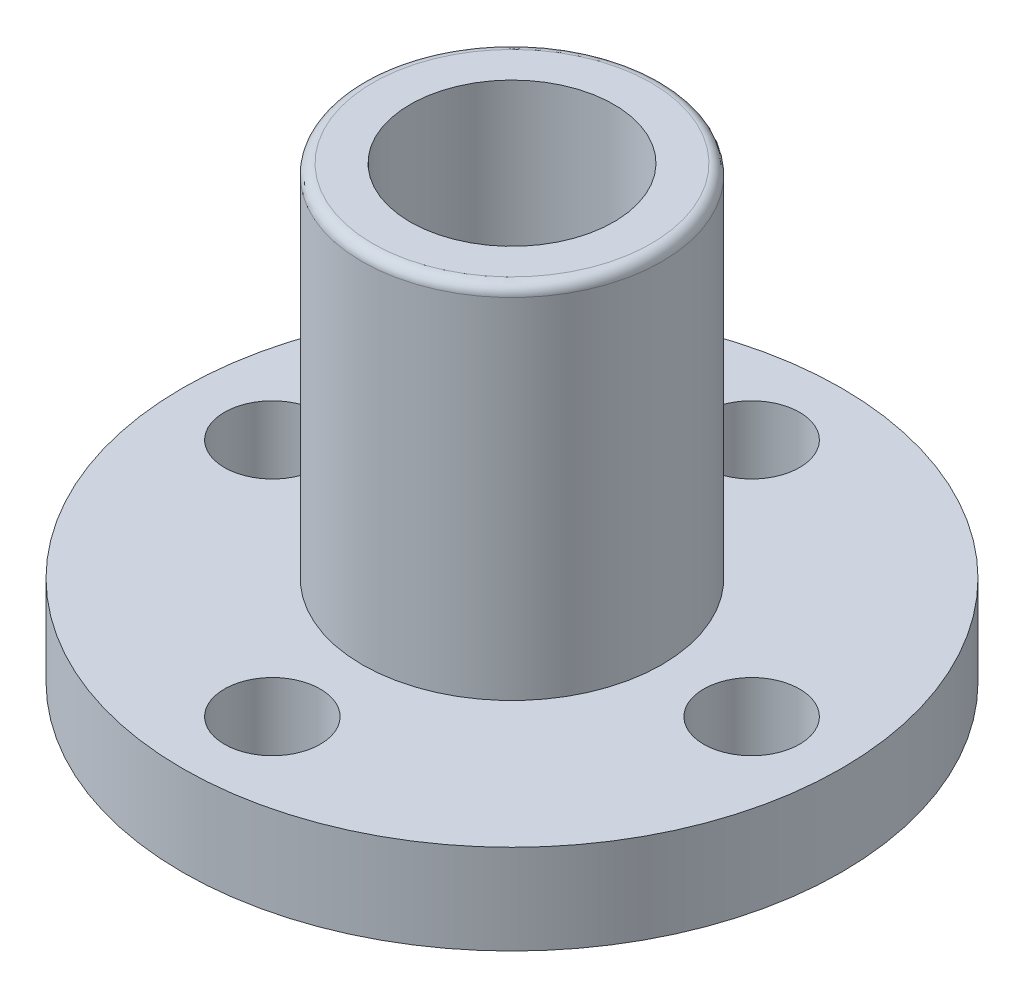
ISO-10303-21;
HEADER;
FILE_DESCRIPTION(('STEP AP214'),'2;1');
FILE_NAME('part.step','',(''),(''),'','','');
FILE_SCHEMA(('AUTOMOTIVE_DESIGN { 1 0 10303 214 1 1 1 1 }'));
ENDSEC;
DATA;
#1=APPLICATION_CONTEXT('core data for automotive mechanical design processes');
#2=APPLICATION_PROTOCOL_DEFINITION('international standard','automotive_design',2000,#1);
#3=PRODUCT_CONTEXT('',#1,'mechanical');
#4=PRODUCT('Part','Part','',(#3));
#5=PRODUCT_RELATED_PRODUCT_CATEGORY('part','',(#4));
#6=PRODUCT_DEFINITION_FORMATION('','',#4);
#7=PRODUCT_DEFINITION_CONTEXT('part definition',#1,'design');
#8=PRODUCT_DEFINITION('design','',#6,#7);
#9=PRODUCT_DEFINITION_SHAPE('','',#8);
#10=(LENGTH_UNIT() NAMED_UNIT(*) SI_UNIT(.MILLI.,.METRE.));
#11=(NAMED_UNIT(*) PLANE_ANGLE_UNIT() SI_UNIT($,.RADIAN.));
#12=(NAMED_UNIT(*) SI_UNIT($,.STERADIAN.) SOLID_ANGLE_UNIT());
#13=UNCERTAINTY_MEASURE_WITH_UNIT(LENGTH_MEASURE(1.E-05),#10,'distance_accuracy_value','');
#14=(GEOMETRIC_REPRESENTATION_CONTEXT(3) GLOBAL_UNCERTAINTY_ASSIGNED_CONTEXT((#13)) GLOBAL_UNIT_ASSIGNED_CONTEXT((#10,
#11,#12)) REPRESENTATION_CONTEXT('',''));
#15=CARTESIAN_POINT('',(0.,0.,0.));
#16=DIRECTION('',(0.,0.,1.));
#17=DIRECTION('',(1.,0.,0.));
#18=AXIS2_PLACEMENT_3D('',#15,#16,#17);
#19=CARTESIAN_POINT('',(0.,0.,0.));
#20=DIRECTION('',(0.,1.,0.));
#21=DIRECTION('',(0.,0.,1.));
#22=AXIS2_PLACEMENT_3D('',#19,#20,#21);
#23=PLANE('',#22);
#24=CARTESIAN_POINT('',(0.,0.,0.));
#25=DIRECTION('',(0.,1.,0.));
#26=DIRECTION('',(0.,0.,1.));
#27=AXIS2_PLACEMENT_3D('',#24,#25,#26);
#28=CIRCLE('',#27,11.);
#29=CARTESIAN_POINT('',(0.,0.,11.));
#30=VERTEX_POINT('',#29);
#31=EDGE_CURVE('E63',#30,#30,#28,.T.);
#32=ORIENTED_EDGE('',*,*,#31,.F.);
#33=EDGE_LOOP('',(#32));
#34=FACE_BOUND('',#33,.T.);
#35=CARTESIAN_POINT('',(0.,0.,-8.));
#36=DIRECTION('',(0.,1.,0.));
#37=DIRECTION('',(0.,0.,1.));
#38=AXIS2_PLACEMENT_3D('',#35,#36,#37);
#39=CIRCLE('',#38,1.6);
#40=CARTESIAN_POINT('',(0.,0.,-6.4));
#41=VERTEX_POINT('',#40);
#42=EDGE_CURVE('E73',#41,#41,#39,.T.);
#43=ORIENTED_EDGE('',*,*,#42,.T.);
#44=EDGE_LOOP('',(#43));
#45=FACE_BOUND('',#44,.T.);
#46=CARTESIAN_POINT('',(8.00000000000023,0.,-2.26393958003914E-13));
#47=DIRECTION('',(0.,1.,0.));
#48=DIRECTION('',(0.,0.,1.));
#49=AXIS2_PLACEMENT_3D('',#46,#47,#48);
#50=CIRCLE('',#49,1.60000000000018);
#51=CARTESIAN_POINT('',(8.00000000000023,0.,1.59999999999995));
#52=VERTEX_POINT('',#51);
#53=EDGE_CURVE('E77',#52,#52,#50,.T.);
#54=ORIENTED_EDGE('',*,*,#53,.T.);
#55=EDGE_LOOP('',(#54));
#56=FACE_BOUND('',#55,.T.);
#57=CARTESIAN_POINT('',(4.52787916007828E-13,0.,8.));
#58=DIRECTION('',(0.,1.,0.));
#59=DIRECTION('',(0.,0.,1.));
#60=AXIS2_PLACEMENT_3D('',#57,#58,#59);
#61=CIRCLE('',#60,1.60000000000049);
#62=CARTESIAN_POINT('',(4.52787916007828E-13,0.,9.60000000000049));
#63=VERTEX_POINT('',#62);
#64=EDGE_CURVE('E84',#63,#63,#61,.T.);
#65=ORIENTED_EDGE('',*,*,#64,.T.);
#66=EDGE_LOOP('',(#65));
#67=FACE_BOUND('',#66,.T.);
#68=CARTESIAN_POINT('',(-7.99999999999977,0.,2.27373675443232E-13));
#69=DIRECTION('',(0.,1.,0.));
#70=DIRECTION('',(0.,0.,1.));
#71=AXIS2_PLACEMENT_3D('',#68,#69,#70);
#72=CIRCLE('',#71,1.60000000000036);
#73=CARTESIAN_POINT('',(-7.99999999999977,0.,1.60000000000059));
#74=VERTEX_POINT('',#73);
#75=EDGE_CURVE('E92',#74,#74,#72,.T.);
#76=ORIENTED_EDGE('',*,*,#75,.T.);
#77=EDGE_LOOP('',(#76));
#78=FACE_BOUND('',#77,.T.);
#79=CARTESIAN_POINT('',(0.,0.,0.));
#80=DIRECTION('',(0.,1.,0.));
#81=DIRECTION('',(0.,0.,1.));
#82=AXIS2_PLACEMENT_3D('',#79,#80,#81);
#83=CIRCLE('',#82,5.);
#84=CARTESIAN_POINT('',(0.,0.,5.));
#85=VERTEX_POINT('',#84);
#86=EDGE_CURVE('E10',#85,#85,#83,.F.);
#87=ORIENTED_EDGE('',*,*,#86,.F.);
#88=EDGE_LOOP('',(#87));
#89=FACE_BOUND('',#88,.T.);
#90=ADVANCED_FACE('F38',(#34,#45,#56,#67,#78,#89),#23,.F.);
#91=CARTESIAN_POINT('',(0.,3.,0.));
#92=DIRECTION('',(0.,1.,0.));
#93=DIRECTION('',(0.,0.,1.));
#94=AXIS2_PLACEMENT_3D('',#91,#92,#93);
#95=PLANE('',#94);
#96=CARTESIAN_POINT('',(-7.99999999999977,3.,2.27373675443232E-13));
#97=DIRECTION('',(0.,1.,0.));
#98=DIRECTION('',(0.,0.,1.));
#99=AXIS2_PLACEMENT_3D('',#96,#97,#98);
#100=CIRCLE('',#99,1.60000000000036);
#101=CARTESIAN_POINT('',(-7.99999999999977,3.,1.60000000000059));
#102=VERTEX_POINT('',#101);
#103=EDGE_CURVE('E96',#102,#102,#100,.T.);
#104=ORIENTED_EDGE('',*,*,#103,.F.);
#105=EDGE_LOOP('',(#104));
#106=FACE_BOUND('',#105,.T.);
#107=CARTESIAN_POINT('',(4.52787916007828E-13,3.,8.));
#108=DIRECTION('',(0.,1.,0.));
#109=DIRECTION('',(0.,0.,1.));
#110=AXIS2_PLACEMENT_3D('',#107,#108,#109);
#111=CIRCLE('',#110,1.60000000000049);
#112=CARTESIAN_POINT('',(4.52787916007828E-13,3.,9.60000000000049));
#113=VERTEX_POINT('',#112);
#114=EDGE_CURVE('E88',#113,#113,#111,.T.);
#115=ORIENTED_EDGE('',*,*,#114,.F.);
#116=EDGE_LOOP('',(#115));
#117=FACE_BOUND('',#116,.T.);
#118=CARTESIAN_POINT('',(8.00000000000023,3.,-2.26393958003914E-13));
#119=DIRECTION('',(0.,1.,0.));
#120=DIRECTION('',(0.,0.,1.));
#121=AXIS2_PLACEMENT_3D('',#118,#119,#120);
#122=CIRCLE('',#121,1.60000000000018);
#123=CARTESIAN_POINT('',(8.00000000000023,3.,1.59999999999995));
#124=VERTEX_POINT('',#123);
#125=EDGE_CURVE('E80',#124,#124,#122,.T.);
#126=ORIENTED_EDGE('',*,*,#125,.F.);
#127=EDGE_LOOP('',(#126));
#128=FACE_BOUND('',#127,.T.);
#129=CARTESIAN_POINT('',(0.,3.,-8.));
#130=DIRECTION('',(0.,1.,0.));
#131=DIRECTION('',(0.,0.,1.));
#132=AXIS2_PLACEMENT_3D('',#129,#130,#131);
#133=CIRCLE('',#132,1.6);
#134=CARTESIAN_POINT('',(0.,3.,-6.4));
#135=VERTEX_POINT('',#134);
#136=EDGE_CURVE('E74',#135,#135,#133,.T.);
#137=ORIENTED_EDGE('',*,*,#136,.F.);
#138=EDGE_LOOP('',(#137));
#139=FACE_BOUND('',#138,.T.);
#140=CARTESIAN_POINT('',(0.,3.,0.));
#141=DIRECTION('',(0.,1.,0.));
#142=DIRECTION('',(0.,0.,1.));
#143=AXIS2_PLACEMENT_3D('',#140,#141,#142);
#144=CIRCLE('',#143,11.);
#145=CARTESIAN_POINT('',(0.,3.,11.));
#146=VERTEX_POINT('',#145);
#147=EDGE_CURVE('E60',#146,#146,#144,.T.);
#148=ORIENTED_EDGE('',*,*,#147,.T.);
#149=EDGE_LOOP('',(#148));
#150=FACE_BOUND('',#149,.T.);
#151=CARTESIAN_POINT('',(0.,3.,0.));
#152=DIRECTION('',(0.,1.,0.));
#153=DIRECTION('',(0.,0.,1.));
#154=AXIS2_PLACEMENT_3D('',#151,#152,#153);
#155=CIRCLE('',#154,5.);
#156=CARTESIAN_POINT('',(0.,3.,5.));
#157=VERTEX_POINT('',#156);
#158=EDGE_CURVE('E67',#157,#157,#155,.T.);
#159=ORIENTED_EDGE('',*,*,#158,.F.);
#160=EDGE_LOOP('',(#159));
#161=FACE_BOUND('',#160,.T.);
#162=ADVANCED_FACE('F140',(#106,#117,#128,#139,#150,#161),#95,.T.);
#163=CARTESIAN_POINT('',(0.,3.,0.));
#164=DIRECTION('',(0.,-1.,0.));
#165=DIRECTION('',(0.,0.,-1.));
#166=AXIS2_PLACEMENT_3D('',#163,#164,#165);
#167=CYLINDRICAL_SURFACE('',#166,11.);
#168=ORIENTED_EDGE('',*,*,#147,.F.);
#169=EDGE_LOOP('',(#168));
#170=FACE_BOUND('',#169,.T.);
#171=ORIENTED_EDGE('',*,*,#31,.T.);
#172=EDGE_LOOP('',(#171));
#173=FACE_BOUND('',#172,.T.);
#174=ADVANCED_FACE('F146',(#170,#173),#167,.T.);
#175=CARTESIAN_POINT('',(0.,15.,0.));
#176=DIRECTION('',(0.,-1.,0.));
#177=DIRECTION('',(0.,0.,-1.));
#178=AXIS2_PLACEMENT_3D('',#175,#176,#177);
#179=CYLINDRICAL_SURFACE('',#178,5.);
#180=CARTESIAN_POINT('',(0.,14.65,0.));
#181=DIRECTION('',(0.,1.,0.));
#182=DIRECTION('',(0.,0.,1.));
#183=AXIS2_PLACEMENT_3D('',#180,#181,#182);
#184=CIRCLE('',#183,5.);
#185=CARTESIAN_POINT('',(0.,14.65,5.));
#186=VERTEX_POINT('',#185);
#187=EDGE_CURVE('E46',#186,#186,#184,.F.);
#188=ORIENTED_EDGE('',*,*,#187,.T.);
#189=EDGE_LOOP('',(#188));
#190=FACE_BOUND('',#189,.T.);
#191=ORIENTED_EDGE('',*,*,#158,.T.);
#192=EDGE_LOOP('',(#191));
#193=FACE_BOUND('',#192,.T.);
#194=ADVANCED_FACE('F121',(#190,#193),#179,.T.);
#195=CARTESIAN_POINT('',(0.,15.,0.));
#196=DIRECTION('',(0.,1.,0.));
#197=DIRECTION('',(0.,0.,1.));
#198=AXIS2_PLACEMENT_3D('',#195,#196,#197);
#199=PLANE('',#198);
#200=CARTESIAN_POINT('',(0.,15.,0.));
#201=DIRECTION('',(0.,1.,0.));
#202=DIRECTION('',(0.,0.,1.));
#203=AXIS2_PLACEMENT_3D('',#200,#201,#202);
#204=CIRCLE('',#203,3.4);
#205=CARTESIAN_POINT('',(0.,15.,3.4));
#206=VERTEX_POINT('',#205);
#207=EDGE_CURVE('E110',#206,#206,#204,.T.);
#208=ORIENTED_EDGE('',*,*,#207,.F.);
#209=EDGE_LOOP('',(#208));
#210=FACE_BOUND('',#209,.T.);
#211=CARTESIAN_POINT('',(0.,15.,0.));
#212=DIRECTION('',(0.,1.,0.));
#213=DIRECTION('',(0.,0.,1.));
#214=AXIS2_PLACEMENT_3D('',#211,#212,#213);
#215=CIRCLE('',#214,4.65);
#216=CARTESIAN_POINT('',(0.,15.,4.65));
#217=VERTEX_POINT('',#216);
#218=EDGE_CURVE('E53',#217,#217,#215,.T.);
#219=ORIENTED_EDGE('',*,*,#218,.T.);
#220=EDGE_LOOP('',(#219));
#221=FACE_BOUND('',#220,.T.);
#222=ADVANCED_FACE('F117',(#210,#221),#199,.T.);
#223=CARTESIAN_POINT('',(0.,0.,-8.));
#224=DIRECTION('',(0.,1.,0.));
#225=DIRECTION('',(0.,0.,1.));
#226=AXIS2_PLACEMENT_3D('',#223,#224,#225);
#227=CYLINDRICAL_SURFACE('',#226,1.6);
#228=ORIENTED_EDGE('',*,*,#42,.F.);
#229=EDGE_LOOP('',(#228));
#230=FACE_BOUND('',#229,.T.);
#231=ORIENTED_EDGE('',*,*,#136,.T.);
#232=EDGE_LOOP('',(#231));
#233=FACE_BOUND('',#232,.T.);
#234=ADVANCED_FACE('F120',(#230,#233),#227,.F.);
#235=CARTESIAN_POINT('',(8.00000000000023,0.,-2.26393958003914E-13));
#236=DIRECTION('',(0.,1.,0.));
#237=DIRECTION('',(0.,0.,1.));
#238=AXIS2_PLACEMENT_3D('',#235,#236,#237);
#239=CYLINDRICAL_SURFACE('',#238,1.60000000000018);
#240=ORIENTED_EDGE('',*,*,#53,.F.);
#241=EDGE_LOOP('',(#240));
#242=FACE_BOUND('',#241,.T.);
#243=ORIENTED_EDGE('',*,*,#125,.T.);
#244=EDGE_LOOP('',(#243));
#245=FACE_BOUND('',#244,.T.);
#246=ADVANCED_FACE('F168',(#242,#245),#239,.F.);
#247=CARTESIAN_POINT('',(4.52787916007828E-13,0.,8.));
#248=DIRECTION('',(0.,1.,0.));
#249=DIRECTION('',(0.,0.,1.));
#250=AXIS2_PLACEMENT_3D('',#247,#248,#249);
#251=CYLINDRICAL_SURFACE('',#250,1.60000000000049);
#252=ORIENTED_EDGE('',*,*,#64,.F.);
#253=EDGE_LOOP('',(#252));
#254=FACE_BOUND('',#253,.T.);
#255=ORIENTED_EDGE('',*,*,#114,.T.);
#256=EDGE_LOOP('',(#255));
#257=FACE_BOUND('',#256,.T.);
#258=ADVANCED_FACE('F136',(#254,#257),#251,.F.);
#259=CARTESIAN_POINT('',(-7.99999999999977,0.,2.27373675443232E-13));
#260=DIRECTION('',(0.,1.,0.));
#261=DIRECTION('',(0.,0.,1.));
#262=AXIS2_PLACEMENT_3D('',#259,#260,#261);
#263=CYLINDRICAL_SURFACE('',#262,1.60000000000036);
#264=ORIENTED_EDGE('',*,*,#75,.F.);
#265=EDGE_LOOP('',(#264));
#266=FACE_BOUND('',#265,.T.);
#267=ORIENTED_EDGE('',*,*,#103,.T.);
#268=EDGE_LOOP('',(#267));
#269=FACE_BOUND('',#268,.T.);
#270=ADVANCED_FACE('F127',(#266,#269),#263,.F.);
#271=CARTESIAN_POINT('',(0.,14.65,0.));
#272=DIRECTION('',(0.,1.,0.));
#273=DIRECTION('',(0.,0.,1.));
#274=AXIS2_PLACEMENT_3D('',#271,#272,#273);
#275=TOROIDAL_SURFACE('',#274,4.65,0.35);
#276=ORIENTED_EDGE('',*,*,#187,.F.);
#277=EDGE_LOOP('',(#276));
#278=FACE_BOUND('',#277,.T.);
#279=ORIENTED_EDGE('',*,*,#218,.F.);
#280=EDGE_LOOP('',(#279));
#281=FACE_BOUND('',#280,.T.);
#282=ADVANCED_FACE('F40',(#278,#281),#275,.T.);
#283=CARTESIAN_POINT('',(0.,-1.5,0.));
#284=DIRECTION('',(0.,1.,0.));
#285=DIRECTION('',(0.,0.,1.));
#286=AXIS2_PLACEMENT_3D('',#283,#284,#285);
#287=CYLINDRICAL_SURFACE('',#286,5.);
#288=CARTESIAN_POINT('',(0.,-1.5,0.));
#289=DIRECTION('',(0.,-1.,0.));
#290=DIRECTION('',(0.,0.,-1.));
#291=AXIS2_PLACEMENT_3D('',#288,#289,#290);
#292=CIRCLE('',#291,5.);
#293=CARTESIAN_POINT('',(0.,-1.5,-5.));
#294=VERTEX_POINT('',#293);
#295=EDGE_CURVE('E99',#294,#294,#292,.T.);
#296=ORIENTED_EDGE('',*,*,#295,.F.);
#297=EDGE_LOOP('',(#296));
#298=FACE_BOUND('',#297,.T.);
#299=ORIENTED_EDGE('',*,*,#86,.T.);
#300=EDGE_LOOP('',(#299));
#301=FACE_BOUND('',#300,.T.);
#302=ADVANCED_FACE('F126',(#298,#301),#287,.T.);
#303=CARTESIAN_POINT('',(0.,-1.5,0.));
#304=DIRECTION('',(0.,-1.,0.));
#305=DIRECTION('',(0.,0.,-1.));
#306=AXIS2_PLACEMENT_3D('',#303,#304,#305);
#307=PLANE('',#306);
#308=CARTESIAN_POINT('',(0.,-1.5,0.));
#309=DIRECTION('',(0.,1.,0.));
#310=DIRECTION('',(0.,0.,1.));
#311=AXIS2_PLACEMENT_3D('',#308,#309,#310);
#312=CIRCLE('',#311,3.4);
#313=CARTESIAN_POINT('',(0.,-1.5,3.4));
#314=VERTEX_POINT('',#313);
#315=EDGE_CURVE('E106',#314,#314,#312,.T.);
#316=ORIENTED_EDGE('',*,*,#315,.T.);
#317=EDGE_LOOP('',(#316));
#318=FACE_BOUND('',#317,.T.);
#319=ORIENTED_EDGE('',*,*,#295,.T.);
#320=EDGE_LOOP('',(#319));
#321=FACE_BOUND('',#320,.T.);
#322=ADVANCED_FACE('F133',(#318,#321),#307,.T.);
#323=CARTESIAN_POINT('',(0.,15.,0.));
#324=DIRECTION('',(0.,1.,0.));
#325=DIRECTION('',(0.,0.,1.));
#326=AXIS2_PLACEMENT_3D('',#323,#324,#325);
#327=CYLINDRICAL_SURFACE('',#326,3.4);
#328=ORIENTED_EDGE('',*,*,#315,.F.);
#329=EDGE_LOOP('',(#328));
#330=FACE_BOUND('',#329,.T.);
#331=ORIENTED_EDGE('',*,*,#207,.T.);
#332=EDGE_LOOP('',(#331));
#333=FACE_BOUND('',#332,.T.);
#334=ADVANCED_FACE('F115',(#330,#333),#327,.F.);
#335=CLOSED_SHELL('',(#90,#162,#174,#194,#222,#234,#246,#258,#270,#282,#302,#322,#334));
#336=MANIFOLD_SOLID_BREP('B2',#335);
#337=ADVANCED_BREP_SHAPE_REPRESENTATION('',(#18,#336),#14);
#338=SHAPE_DEFINITION_REPRESENTATION(#9,#337);
ENDSEC;
END-ISO-10303-21;
